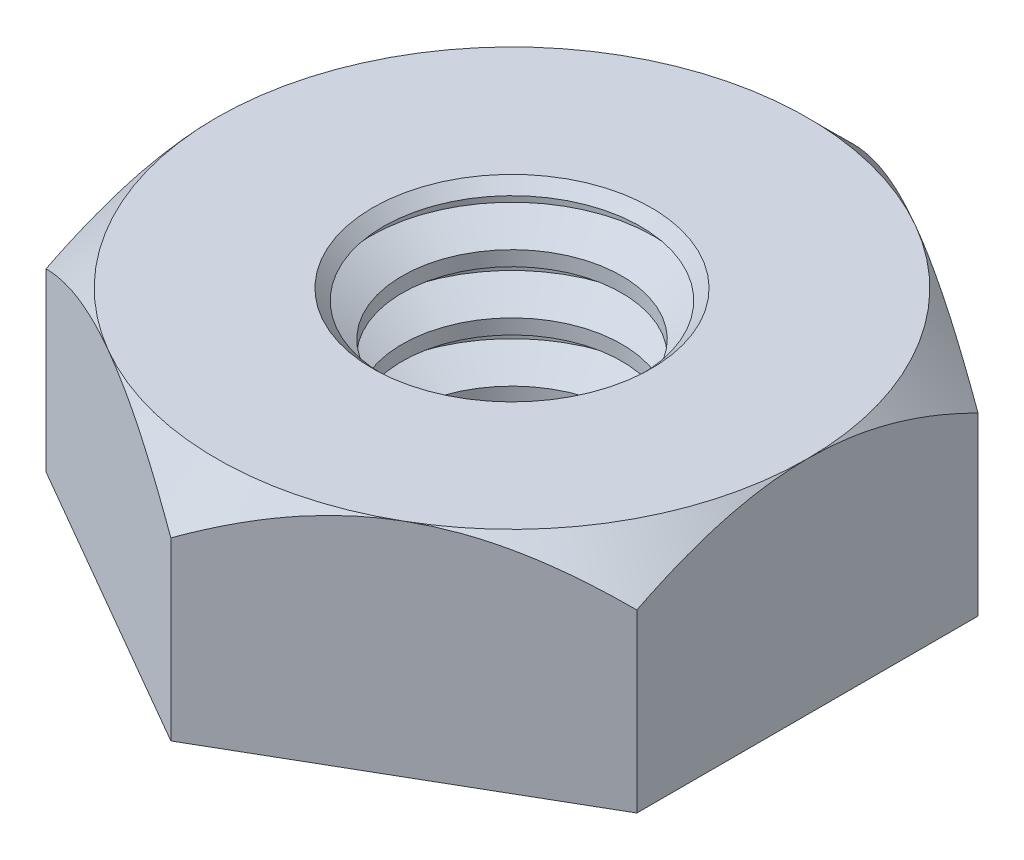
ISO-10303-21;
HEADER;
FILE_DESCRIPTION(('STEP AP214'),'2;1');
FILE_NAME('part.step','',(''),(''),'','','');
FILE_SCHEMA(('AUTOMOTIVE_DESIGN { 1 0 10303 214 1 1 1 1 }'));
ENDSEC;
DATA;
#1=APPLICATION_CONTEXT('core data for automotive mechanical design processes');
#2=APPLICATION_PROTOCOL_DEFINITION('international standard','automotive_design',2000,#1);
#3=PRODUCT_CONTEXT('',#1,'mechanical');
#4=PRODUCT('Part','Part','',(#3));
#5=PRODUCT_RELATED_PRODUCT_CATEGORY('part','',(#4));
#6=PRODUCT_DEFINITION_FORMATION('','',#4);
#7=PRODUCT_DEFINITION_CONTEXT('part definition',#1,'design');
#8=PRODUCT_DEFINITION('design','',#6,#7);
#9=PRODUCT_DEFINITION_SHAPE('','',#8);
#10=(LENGTH_UNIT() NAMED_UNIT(*) SI_UNIT(.MILLI.,.METRE.));
#11=(NAMED_UNIT(*) PLANE_ANGLE_UNIT() SI_UNIT($,.RADIAN.));
#12=(NAMED_UNIT(*) SI_UNIT($,.STERADIAN.) SOLID_ANGLE_UNIT());
#13=UNCERTAINTY_MEASURE_WITH_UNIT(LENGTH_MEASURE(1.E-05),#10,'distance_accuracy_value','');
#14=(GEOMETRIC_REPRESENTATION_CONTEXT(3) GLOBAL_UNCERTAINTY_ASSIGNED_CONTEXT((#13)) GLOBAL_UNIT_ASSIGNED_CONTEXT((#10,
#11,#12)) REPRESENTATION_CONTEXT('',''));
#15=CARTESIAN_POINT('',(0.,0.,0.));
#16=DIRECTION('',(0.,0.,1.));
#17=DIRECTION('',(1.,0.,0.));
#18=AXIS2_PLACEMENT_3D('',#15,#16,#17);
#19=CARTESIAN_POINT('',(0.,0.41671875,0.));
#20=DIRECTION('',(0.,1.,0.));
#21=DIRECTION('',(-1.,0.,0.));
#22=AXIS2_PLACEMENT_3D('',#19,#20,#21);
#23=CYLINDRICAL_SURFACE('',#22,0.762);
#24=CARTESIAN_POINT('',(0.,0.416718749999934,0.));
#25=DIRECTION('',(0.,1.,0.));
#26=DIRECTION('',(0.,0.,1.));
#27=AXIS2_PLACEMENT_3D('',#24,#25,#26);
#28=CIRCLE('',#27,0.762);
#29=CARTESIAN_POINT('',(0.,0.41671875,0.762));
#30=VERTEX_POINT('',#29);
#31=EDGE_CURVE('E134',#30,#30,#28,.T.);
#32=ORIENTED_EDGE('',*,*,#31,.F.);
#33=EDGE_LOOP('',(#32));
#34=FACE_BOUND('',#33,.T.);
#35=CARTESIAN_POINT('',(0.,0.456406249999985,0.));
#36=DIRECTION('',(0.,-1.,0.));
#37=DIRECTION('',(0.,0.,-1.));
#38=AXIS2_PLACEMENT_3D('',#35,#36,#37);
#39=CIRCLE('',#38,0.762);
#40=CARTESIAN_POINT('',(0.,0.45640625,-0.762));
#41=VERTEX_POINT('',#40);
#42=EDGE_CURVE('E137',#41,#41,#39,.T.);
#43=ORIENTED_EDGE('',*,*,#42,.F.);
#44=EDGE_LOOP('',(#43));
#45=FACE_BOUND('',#44,.T.);
#46=ADVANCED_FACE('F16',(#34,#45),#23,.F.);
#47=CARTESIAN_POINT('',(0.,0.555625,0.));
#48=DIRECTION('',(0.,-1.,0.));
#49=DIRECTION('',(1.,0.,0.));
#50=AXIS2_PLACEMENT_3D('',#47,#48,#49);
#51=CONICAL_SURFACE('',#50,0.5901480958,1.04719752130438);
#52=CARTESIAN_POINT('',(0.,0.555625,0.));
#53=DIRECTION('',(0.,1.,0.));
#54=DIRECTION('',(0.,0.,1.));
#55=AXIS2_PLACEMENT_3D('',#52,#53,#54);
#56=CIRCLE('',#55,0.5901480958);
#57=CARTESIAN_POINT('',(0.,0.555625,0.5901480958));
#58=VERTEX_POINT('',#57);
#59=EDGE_CURVE('E131',#58,#58,#56,.F.);
#60=ORIENTED_EDGE('',*,*,#59,.F.);
#61=EDGE_LOOP('',(#60));
#62=FACE_BOUND('',#61,.T.);
#63=ORIENTED_EDGE('',*,*,#42,.T.);
#64=EDGE_LOOP('',(#63));
#65=FACE_BOUND('',#64,.T.);
#66=ADVANCED_FACE('F286',(#62,#65),#51,.F.);
#67=CARTESIAN_POINT('',(0.,0.3175,0.));
#68=DIRECTION('',(0.,1.,0.));
#69=DIRECTION('',(0.,0.,1.));
#70=AXIS2_PLACEMENT_3D('',#67,#68,#69);
#71=CONICAL_SURFACE('',#70,0.5901480958,1.04719752130438);
#72=CARTESIAN_POINT('',(0.,0.3175,0.));
#73=DIRECTION('',(0.,1.,0.));
#74=DIRECTION('',(0.,0.,1.));
#75=AXIS2_PLACEMENT_3D('',#72,#73,#74);
#76=CIRCLE('',#75,0.5901480958);
#77=CARTESIAN_POINT('',(0.,0.3175,0.5901480958));
#78=VERTEX_POINT('',#77);
#79=EDGE_CURVE('E128',#78,#78,#76,.T.);
#80=ORIENTED_EDGE('',*,*,#79,.F.);
#81=EDGE_LOOP('',(#80));
#82=FACE_BOUND('',#81,.T.);
#83=ORIENTED_EDGE('',*,*,#31,.T.);
#84=EDGE_LOOP('',(#83));
#85=FACE_BOUND('',#84,.T.);
#86=ADVANCED_FACE('F282',(#82,#85),#71,.F.);
#87=CARTESIAN_POINT('',(0.,0.555625,0.));
#88=DIRECTION('',(0.,1.,0.));
#89=DIRECTION('',(-1.,0.,0.));
#90=AXIS2_PLACEMENT_3D('',#87,#88,#89);
#91=CYLINDRICAL_SURFACE('',#90,0.5901480958);
#92=ORIENTED_EDGE('',*,*,#59,.T.);
#93=EDGE_LOOP('',(#92));
#94=FACE_BOUND('',#93,.T.);
#95=CARTESIAN_POINT('',(0.,0.635000000000052,0.));
#96=DIRECTION('',(0.,1.,0.));
#97=DIRECTION('',(0.,0.,1.));
#98=AXIS2_PLACEMENT_3D('',#95,#96,#97);
#99=CIRCLE('',#98,0.5901480958);
#100=CARTESIAN_POINT('',(0.,0.635,0.5901480958));
#101=VERTEX_POINT('',#100);
#102=EDGE_CURVE('E125',#101,#101,#99,.F.);
#103=ORIENTED_EDGE('',*,*,#102,.F.);
#104=EDGE_LOOP('',(#103));
#105=FACE_BOUND('',#104,.T.);
#106=ADVANCED_FACE('F278',(#94,#105),#91,.F.);
#107=CARTESIAN_POINT('',(0.,0.238125,0.));
#108=DIRECTION('',(0.,1.,0.));
#109=DIRECTION('',(0.,0.,1.));
#110=AXIS2_PLACEMENT_3D('',#107,#108,#109);
#111=CYLINDRICAL_SURFACE('',#110,0.5901480958);
#112=CARTESIAN_POINT('',(0.,0.238124999999978,0.));
#113=DIRECTION('',(0.,-1.,0.));
#114=DIRECTION('',(0.,0.,-1.));
#115=AXIS2_PLACEMENT_3D('',#112,#113,#114);
#116=CIRCLE('',#115,0.5901480958);
#117=CARTESIAN_POINT('',(0.,0.238125,-0.5901480958));
#118=VERTEX_POINT('',#117);
#119=EDGE_CURVE('E122',#118,#118,#116,.F.);
#120=ORIENTED_EDGE('',*,*,#119,.F.);
#121=EDGE_LOOP('',(#120));
#122=FACE_BOUND('',#121,.T.);
#123=ORIENTED_EDGE('',*,*,#79,.T.);
#124=EDGE_LOOP('',(#123));
#125=FACE_BOUND('',#124,.T.);
#126=ADVANCED_FACE('F274',(#122,#125),#111,.F.);
#127=CARTESIAN_POINT('',(0.,0.635,0.));
#128=DIRECTION('',(0.,1.,0.));
#129=DIRECTION('',(0.,0.,1.));
#130=AXIS2_PLACEMENT_3D('',#127,#128,#129);
#131=CONICAL_SURFACE('',#130,0.5901480958,1.04719752130438);
#132=ORIENTED_EDGE('',*,*,#102,.T.);
#133=EDGE_LOOP('',(#132));
#134=FACE_BOUND('',#133,.T.);
#135=CARTESIAN_POINT('',(0.,0.73421875,0.));
#136=DIRECTION('',(0.,1.,0.));
#137=DIRECTION('',(0.,0.,1.));
#138=AXIS2_PLACEMENT_3D('',#135,#136,#137);
#139=CIRCLE('',#138,0.762);
#140=CARTESIAN_POINT('',(0.,0.73421875,0.762));
#141=VERTEX_POINT('',#140);
#142=EDGE_CURVE('E118',#141,#141,#139,.F.);
#143=ORIENTED_EDGE('',*,*,#142,.F.);
#144=EDGE_LOOP('',(#143));
#145=FACE_BOUND('',#144,.T.);
#146=ADVANCED_FACE('F270',(#134,#145),#131,.F.);
#147=CARTESIAN_POINT('',(0.,0.238125,0.));
#148=DIRECTION('',(0.,-1.,0.));
#149=DIRECTION('',(0.,0.,-1.));
#150=AXIS2_PLACEMENT_3D('',#147,#148,#149);
#151=CONICAL_SURFACE('',#150,0.5901480958,1.04719752130438);
#152=ORIENTED_EDGE('',*,*,#119,.T.);
#153=EDGE_LOOP('',(#152));
#154=FACE_BOUND('',#153,.T.);
#155=CARTESIAN_POINT('',(0.,0.13890625,0.));
#156=DIRECTION('',(0.,1.,0.));
#157=DIRECTION('',(0.,0.,1.));
#158=AXIS2_PLACEMENT_3D('',#155,#156,#157);
#159=CIRCLE('',#158,0.762);
#160=CARTESIAN_POINT('',(0.,0.13890625,0.762));
#161=VERTEX_POINT('',#160);
#162=EDGE_CURVE('E113',#161,#161,#159,.T.);
#163=ORIENTED_EDGE('',*,*,#162,.F.);
#164=EDGE_LOOP('',(#163));
#165=FACE_BOUND('',#164,.T.);
#166=ADVANCED_FACE('F266',(#154,#165),#151,.F.);
#167=CARTESIAN_POINT('',(0.,0.73421875,0.));
#168=DIRECTION('',(0.,1.,0.));
#169=DIRECTION('',(-1.,0.,0.));
#170=AXIS2_PLACEMENT_3D('',#167,#168,#169);
#171=CYLINDRICAL_SURFACE('',#170,0.762);
#172=ORIENTED_EDGE('',*,*,#142,.T.);
#173=EDGE_LOOP('',(#172));
#174=FACE_BOUND('',#173,.T.);
#175=CARTESIAN_POINT('',(0.,0.773906249999956,0.));
#176=DIRECTION('',(0.,-1.,0.));
#177=DIRECTION('',(0.,0.,-1.));
#178=AXIS2_PLACEMENT_3D('',#175,#176,#177);
#179=CIRCLE('',#178,0.762);
#180=CARTESIAN_POINT('',(0.,0.77390625,-0.762));
#181=VERTEX_POINT('',#180);
#182=EDGE_CURVE('E111',#181,#181,#179,.T.);
#183=ORIENTED_EDGE('',*,*,#182,.F.);
#184=EDGE_LOOP('',(#183));
#185=FACE_BOUND('',#184,.T.);
#186=ADVANCED_FACE('F262',(#174,#185),#171,.F.);
#187=CARTESIAN_POINT('',(0.,0.09921875,0.));
#188=DIRECTION('',(0.,1.,0.));
#189=DIRECTION('',(-1.,0.,0.));
#190=AXIS2_PLACEMENT_3D('',#187,#188,#189);
#191=CYLINDRICAL_SURFACE('',#190,0.762);
#192=CARTESIAN_POINT('',(0.,0.0992187500000741,0.));
#193=DIRECTION('',(0.,1.,0.));
#194=DIRECTION('',(0.,0.,1.));
#195=AXIS2_PLACEMENT_3D('',#192,#193,#194);
#196=CIRCLE('',#195,0.762);
#197=CARTESIAN_POINT('',(0.,0.09921875,0.762));
#198=VERTEX_POINT('',#197);
#199=EDGE_CURVE('E377',#198,#198,#196,.T.);
#200=ORIENTED_EDGE('',*,*,#199,.F.);
#201=EDGE_LOOP('',(#200));
#202=FACE_BOUND('',#201,.T.);
#203=ORIENTED_EDGE('',*,*,#162,.T.);
#204=EDGE_LOOP('',(#203));
#205=FACE_BOUND('',#204,.T.);
#206=ADVANCED_FACE('F258',(#202,#205),#191,.F.);
#207=CARTESIAN_POINT('',(0.,0.873125,0.));
#208=DIRECTION('',(0.,-1.,0.));
#209=DIRECTION('',(0.,0.,-1.));
#210=AXIS2_PLACEMENT_3D('',#207,#208,#209);
#211=CONICAL_SURFACE('',#210,0.5901480958,1.04719752130438);
#212=CARTESIAN_POINT('',(0.,0.873125,0.));
#213=DIRECTION('',(0.,1.,0.));
#214=DIRECTION('',(0.,0.,1.));
#215=AXIS2_PLACEMENT_3D('',#212,#213,#214);
#216=CIRCLE('',#215,0.5901480958);
#217=CARTESIAN_POINT('',(0.,0.873125,0.5901480958));
#218=VERTEX_POINT('',#217);
#219=EDGE_CURVE('E375',#218,#218,#216,.F.);
#220=ORIENTED_EDGE('',*,*,#219,.F.);
#221=EDGE_LOOP('',(#220));
#222=FACE_BOUND('',#221,.T.);
#223=ORIENTED_EDGE('',*,*,#182,.T.);
#224=EDGE_LOOP('',(#223));
#225=FACE_BOUND('',#224,.T.);
#226=ADVANCED_FACE('F255',(#222,#225),#211,.F.);
#227=CARTESIAN_POINT('',(-1.5875,0.,-0.9165435568));
#228=DIRECTION('',(0.500000001825392,0.,0.866025402730548));
#229=DIRECTION('',(0.866025402730548,0.,-0.500000001825392));
#230=AXIS2_PLACEMENT_3D('',#227,#228,#229);
#231=PLANE('',#230);
#232=DIRECTION('',(0.,-1.,0.));
#233=VECTOR('',#232,1.);
#234=CARTESIAN_POINT('',(0.,0.598884375,-1.8330871136));
#235=LINE('',#234,#233);
#236=CARTESIAN_POINT('',(-2.37763028148505E-09,0.945037887772726,-1.83308711222727));
#237=VERTEX_POINT('',#236);
#238=CARTESIAN_POINT('',(0.,0.,-1.8330871136));
#239=VERTEX_POINT('',#238);
#240=EDGE_CURVE('E331',#237,#239,#235,.T.);
#241=ORIENTED_EDGE('',*,*,#240,.T.);
#242=DIRECTION('',(0.866025402730548,0.,-0.500000001825392));
#243=VECTOR('',#242,1.);
#244=CARTESIAN_POINT('',(-1.5875,0.,-0.9165435568));
#245=LINE('',#244,#243);
#246=CARTESIAN_POINT('',(-1.5875,0.,-0.9165435568));
#247=VERTEX_POINT('',#246);
#248=EDGE_CURVE('E94',#239,#247,#245,.F.);
#249=ORIENTED_EDGE('',*,*,#248,.T.);
#250=DIRECTION('',(0.,-1.,0.));
#251=VECTOR('',#250,1.);
#252=CARTESIAN_POINT('',(-1.5875,0.598884375,-0.9165435568));
#253=LINE('',#252,#251);
#254=CARTESIAN_POINT('',(-1.5875,0.945037893873366,-0.916543555237676));
#255=VERTEX_POINT('',#254);
#256=EDGE_CURVE('E91',#255,#247,#253,.T.);
#257=ORIENTED_EDGE('',*,*,#256,.F.);
#258=CARTESIAN_POINT('',(-0.793750000552454,1.19062499366369,-1.37481533337376));
#259=CARTESIAN_POINT('',(-0.835986126793097,1.19066585235424,-1.35043029536721));
#260=CARTESIAN_POINT('',(-0.878200757029689,1.18837855153961,-1.32605766751364));
#261=CARTESIAN_POINT('',(-0.962212733226221,1.17946872747669,-1.27755333049438));
#262=CARTESIAN_POINT('',(-1.00401069183696,1.17285398747406,-1.25342126761548));
#263=CARTESIAN_POINT('',(-1.08634310881512,1.15573831910838,-1.20588662420239));
#264=CARTESIAN_POINT('',(-1.12688711564796,1.14529750606171,-1.18247853085707));
#265=CARTESIAN_POINT('',(-1.207203097129,1.12099489836542,-1.13610807712362));
#266=CARTESIAN_POINT('',(-1.24697482576967,1.10713203230411,-1.113145858768));
#267=CARTESIAN_POINT('',(-1.33771942050805,1.07179492466665,-1.06075444230572));
#268=CARTESIAN_POINT('',(-1.38838771960623,1.04929020434904,-1.03150108604173));
#269=CARTESIAN_POINT('',(-1.48878951499315,1.00006445002032,-0.973534082170124));
#270=CARTESIAN_POINT('',(-1.53850808392261,0.973302520795781,-0.944829052877444));
#271=CARTESIAN_POINT('',(-1.58749999817515,0.945037894145785,-0.916543557853581));
#272=B_SPLINE_CURVE_WITH_KNOTS('',3,(#258,#259,#260,#261,#262,#263,#264,#265,#266,#267,#268,
#269,#270,#271),.UNSPECIFIED.,.F.,.F.,(4,2,2,2,2,2,4),(0.,0.146217040488063,0.292171818267053,
0.435925335012758,0.579723916806516,0.767612797569133,0.957429661101636),.UNSPECIFIED.);
#273=CARTESIAN_POINT('',(-0.793750000314738,1.19062499710219,-1.37481533167218));
#274=VERTEX_POINT('',#273);
#275=EDGE_CURVE('E20',#274,#255,#272,.T.);
#276=ORIENTED_EDGE('',*,*,#275,.F.);
#277=CARTESIAN_POINT('',(-4.65921772675704E-09,0.945037889009626,-1.83308711055237));
#278=CARTESIAN_POINT('',(-0.0549115002484921,0.97671119119828,-1.80138394386697));
#279=CARTESIAN_POINT('',(-0.11075107016014,1.00651329718213,-1.76914495308422));
#280=CARTESIAN_POINT('',(-0.224656508605619,1.06104947999327,-1.70338161728472));
#281=CARTESIAN_POINT('',(-0.282734284439278,1.08575009449029,-1.66985039758442));
#282=CARTESIAN_POINT('',(-0.399072122464851,1.12769739618767,-1.60268271513841));
#283=CARTESIAN_POINT('',(-0.457277830425626,1.14513985429823,-1.5690776338219));
#284=CARTESIAN_POINT('',(-0.57493786798493,1.17201369767989,-1.50114657913809));
#285=CARTESIAN_POINT('',(-0.634387806870194,1.18146955615573,-1.46682314075032));
#286=CARTESIAN_POINT('',(-0.710630746621199,1.18784197572254,-1.4228042587466));
#287=CARTESIAN_POINT('',(-0.727201517400413,1.18888193731125,-1.41323711973002));
#288=CARTESIAN_POINT('',(-0.760430415469626,1.19027453907862,-1.39405240639158));
#289=CARTESIAN_POINT('',(-0.777088628790848,1.19062444045338,-1.38443478239958));
#290=CARTESIAN_POINT('',(-0.793750001171269,1.19062499420438,-1.37481533452377));
#291=B_SPLINE_CURVE_WITH_KNOTS('',3,(#277,#278,#279,#280,#281,#282,#283,#284,#285,#286,#287,
#288,#289,#290),.UNSPECIFIED.,.F.,.F.,(4,2,2,2,2,2,4),(0.,0.212787984996615,0.426930246192678,
0.634848855551885,0.842128007724277,0.899606630997608,0.957312927700399),.UNSPECIFIED.);
#292=EDGE_CURVE('E98',#237,#274,#291,.T.);
#293=ORIENTED_EDGE('',*,*,#292,.F.);
#294=EDGE_LOOP('',(#241,#249,#257,#276,#293));
#295=FACE_BOUND('',#294,.T.);
#296=ADVANCED_FACE('F93',(#295),#231,.F.);
#297=CARTESIAN_POINT('',(0.,0.,1.8330871136));
#298=DIRECTION('',(0.500000001825392,0.,-0.866025402730548));
#299=DIRECTION('',(-0.866025402730548,0.,-0.500000001825392));
#300=AXIS2_PLACEMENT_3D('',#297,#298,#299);
#301=PLANE('',#300);
#302=DIRECTION('',(0.,1.,0.));
#303=VECTOR('',#302,1.);
#304=CARTESIAN_POINT('',(-1.5875,0.598884375,0.9165435568));
#305=LINE('',#304,#303);
#306=CARTESIAN_POINT('',(-1.5875,0.,0.9165435568));
#307=VERTEX_POINT('',#306);
#308=CARTESIAN_POINT('',(-1.58749999913226,0.945037894389001,0.916543555709377));
#309=VERTEX_POINT('',#308);
#310=EDGE_CURVE('E188',#307,#309,#305,.T.);
#311=ORIENTED_EDGE('',*,*,#310,.F.);
#312=DIRECTION('',(-0.866025402730548,0.,-0.500000001825392));
#313=VECTOR('',#312,1.);
#314=CARTESIAN_POINT('',(0.,0.,1.8330871136));
#315=LINE('',#314,#313);
#316=CARTESIAN_POINT('',(0.,0.,1.8330871136));
#317=VERTEX_POINT('',#316);
#318=EDGE_CURVE('E371',#307,#317,#315,.F.);
#319=ORIENTED_EDGE('',*,*,#318,.T.);
#320=DIRECTION('',(0.,1.,0.));
#321=VECTOR('',#320,1.);
#322=CARTESIAN_POINT('',(0.,0.598884375,1.8330871136));
#323=LINE('',#322,#321);
#324=CARTESIAN_POINT('',(0.,0.945037888244041,1.83308711175596));
#325=VERTEX_POINT('',#324);
#326=EDGE_CURVE('E223',#317,#325,#323,.T.);
#327=ORIENTED_EDGE('',*,*,#326,.T.);
#328=CARTESIAN_POINT('',(-0.793750000631719,1.19062499366369,1.37481533332799));
#329=CARTESIAN_POINT('',(-0.75151387501637,1.19066585203127,1.39920037290695));
#330=CARTESIAN_POINT('',(-0.709299244925699,1.1883785508714,1.42357300146809));
#331=CARTESIAN_POINT('',(-0.625287268615773,1.17946872609469,1.47207733913095));
#332=CARTESIAN_POINT('',(-0.583489309746431,1.17285398572375,1.49620940194726));
#333=CARTESIAN_POINT('',(-0.501156892388047,1.15573831662181,1.54374404542721));
#334=CARTESIAN_POINT('',(-0.46061288543158,1.14529750320645,1.56715213889908));
#335=CARTESIAN_POINT('',(-0.380296903691365,1.12099489478114,1.61352259282332));
#336=CARTESIAN_POINT('',(-0.340525174915156,1.10713202835944,1.63648481124316));
#337=CARTESIAN_POINT('',(-0.249780580168895,1.07179492002008,1.6888762276949));
#338=CARTESIAN_POINT('',(-0.199112281196876,1.04929019939426,1.7181295838903));
#339=CARTESIAN_POINT('',(-0.0987104860673466,1.0000644445216,1.77609658762194));
#340=CARTESIAN_POINT('',(-0.0489919172687792,0.973302515062867,1.80480161684343));
#341=CARTESIAN_POINT('',(-3.13276614025397E-09,0.945037888208704,1.8330871117913));
#342=B_SPLINE_CURVE_WITH_KNOTS('',3,(#328,#329,#330,#331,#332,#333,#334,#335,#336,#337,#338,
#339,#340,#341),.UNSPECIFIED.,.F.,.F.,(4,2,2,2,2,2,4),(0.,0.1462170412178,0.29217181971837,
0.435925337204307,0.579723919740895,0.76761280043884,0.957429663869614),.UNSPECIFIED.);
#343=CARTESIAN_POINT('',(-0.7937500005129,1.19062499710219,1.37481533155778));
#344=VERTEX_POINT('',#343);
#345=EDGE_CURVE('E195',#344,#325,#342,.T.);
#346=ORIENTED_EDGE('',*,*,#345,.F.);
#347=CARTESIAN_POINT('',(-1.58749999774577,0.945037893764427,0.916543557233234));
#348=CARTESIAN_POINT('',(-1.53258850307019,0.976711195522724,0.948246724176064));
#349=CARTESIAN_POINT('',(-1.47674893385683,1.00651330101113,0.980485714878221));
#350=CARTESIAN_POINT('',(-1.36284349666052,1.06104948281587,1.04624905019398));
#351=CARTESIAN_POINT('',(-1.30476572137713,1.08575009680314,1.07978026948887));
#352=CARTESIAN_POINT('',(-1.1884278845377,1.12769739761894,1.14694795118818));
#353=CARTESIAN_POINT('',(-1.13022217720971,1.14513985535387,1.18055303216196));
#354=CARTESIAN_POINT('',(-1.01256214093965,1.172013698138,1.24848408611715));
#355=CARTESIAN_POINT('',(-0.953112202710606,1.18146955639069,1.28280752411926));
#356=CARTESIAN_POINT('',(-0.876869262340939,1.18784197592357,1.32682640647881));
#357=CARTESIAN_POINT('',(-0.86029849027417,1.18888193754781,1.33639354623891));
#358=CARTESIAN_POINT('',(-0.827069589617772,1.1902745392788,1.35557826107136));
#359=CARTESIAN_POINT('',(-0.810411374996908,1.19062444058097,1.36519588581385));
#360=CARTESIAN_POINT('',(-0.79375000131825,1.19062499420438,1.37481533443891));
#361=B_SPLINE_CURVE_WITH_KNOTS('',3,(#347,#348,#349,#350,#351,#352,#353,#354,#355,#356,#357,
#358,#359,#360),.UNSPECIFIED.,.F.,.F.,(4,2,2,2,2,2,4),(0.,0.212787982621738,0.426930241377877,
0.63484884837626,0.842127998215692,0.899606625946187,0.957312927144079),.UNSPECIFIED.);
#362=EDGE_CURVE('E179',#309,#344,#361,.T.);
#363=ORIENTED_EDGE('',*,*,#362,.F.);
#364=EDGE_LOOP('',(#311,#319,#327,#346,#363));
#365=FACE_BOUND('',#364,.T.);
#366=ADVANCED_FACE('F200',(#365),#301,.F.);
#367=CARTESIAN_POINT('',(1.5875,0.,0.9165435568));
#368=DIRECTION('',(-0.500000001825392,0.,-0.866025402730548));
#369=DIRECTION('',(-0.866025402730548,0.,0.500000001825392));
#370=AXIS2_PLACEMENT_3D('',#367,#368,#369);
#371=PLANE('',#370);
#372=ORIENTED_EDGE('',*,*,#326,.F.);
#373=DIRECTION('',(-0.866025402730548,0.,0.500000001825392));
#374=VECTOR('',#373,1.);
#375=CARTESIAN_POINT('',(1.5875,0.,0.9165435568));
#376=LINE('',#375,#374);
#377=CARTESIAN_POINT('',(1.5875,0.,0.9165435568));
#378=VERTEX_POINT('',#377);
#379=EDGE_CURVE('E360',#317,#378,#376,.F.);
#380=ORIENTED_EDGE('',*,*,#379,.T.);
#381=DIRECTION('',(0.,1.,0.));
#382=VECTOR('',#381,1.);
#383=CARTESIAN_POINT('',(1.5875,0.598884375,0.9165435568));
#384=LINE('',#383,#382);
#385=CARTESIAN_POINT('',(1.58749999956214,0.945037893597803,0.9165435565472));
#386=VERTEX_POINT('',#385);
#387=EDGE_CURVE('E368',#378,#386,#384,.T.);
#388=ORIENTED_EDGE('',*,*,#387,.T.);
#389=CARTESIAN_POINT('',(0.793750000693443,1.19062499366369,1.37481533329236));
#390=CARTESIAN_POINT('',(0.835986126937543,1.19066585234924,1.35043029528381));
#391=CARTESIAN_POINT('',(0.87820075717736,1.18837855152924,1.32605766742838));
#392=CARTESIAN_POINT('',(0.962212733379833,1.1794687274552,1.27755333040569));
#393=CARTESIAN_POINT('',(1.00401069199329,1.17285398744682,1.25342126752522));
#394=CARTESIAN_POINT('',(1.08634310897627,1.15573831906968,1.20588662410934));
#395=CARTESIAN_POINT('',(1.12688711581123,1.14529750601732,1.1824785307628));
#396=CARTESIAN_POINT('',(1.20720309729625,1.1209948983098,1.13610807702706));
#397=CARTESIAN_POINT('',(1.24697482593878,1.10713203224295,1.11314585867036));
#398=CARTESIAN_POINT('',(1.33771942081786,1.07179492453986,1.06075444212685));
#399=CARTESIAN_POINT('',(1.3883877200509,1.04929020414907,1.031501085785));
#400=CARTESIAN_POINT('',(1.48878951570279,1.00006444965429,0.973534081760416));
#401=CARTESIAN_POINT('',(1.53850808476223,0.973302520336575,0.944829052392691));
#402=CARTESIAN_POINT('',(1.58749999914106,0.945037893588115,0.916543557295911));
#403=B_SPLINE_CURVE_WITH_KNOTS('',3,(#389,#390,#391,#392,#393,#394,#395,#396,#397,#398,#399,
#400,#401,#402),.UNSPECIFIED.,.F.,.F.,(4,2,2,2,2,2,4),(0.,0.146217040499969,0.292171818290612,
0.435925335047192,0.579723916851971,0.767612798128207,0.957429662185306),.UNSPECIFIED.);
#404=CARTESIAN_POINT('',(0.793750000667211,1.19062499710219,1.37481533146868));
#405=VERTEX_POINT('',#404);
#406=EDGE_CURVE('E187',#405,#386,#403,.T.);
#407=ORIENTED_EDGE('',*,*,#406,.F.);
#408=CARTESIAN_POINT('',(3.55288529599181E-09,0.945037888751622,1.8330871128852));
#409=CARTESIAN_POINT('',(0.0549114989771714,0.976711190648004,1.8013839452103));
#410=CARTESIAN_POINT('',(0.110751068906773,1.00651329658194,1.76914495397142));
#411=CARTESIAN_POINT('',(0.224656507566879,1.06104947949634,1.70338161771984));
#412=CARTESIAN_POINT('',(0.282734283598623,1.08575009414683,1.66985039802638));
#413=CARTESIAN_POINT('',(0.399072121986267,1.1276973960542,1.60268271545685));
#414=CARTESIAN_POINT('',(0.457277830111996,1.14513985422371,1.56907763401386));
#415=CARTESIAN_POINT('',(0.574937868017724,1.17201369769023,1.50114657910831));
#416=CARTESIAN_POINT('',(0.634387807084296,1.18146955619258,1.46682314062524));
#417=CARTESIAN_POINT('',(0.710630746973237,1.18784197574666,1.42280425854376));
#418=CARTESIAN_POINT('',(0.727201517710754,1.18888193732808,1.41323711955104));
#419=CARTESIAN_POINT('',(0.760430415695674,1.19027453908427,1.39405240626087));
#420=CARTESIAN_POINT('',(0.777088628974298,1.19062444045517,1.38443478229326));
#421=CARTESIAN_POINT('',(0.793750001312258,1.19062499420438,1.37481533444237));
#422=B_SPLINE_CURVE_WITH_KNOTS('',3,(#408,#409,#410,#411,#412,#413,#414,#415,#416,#417,#418,
#419,#420,#421),.UNSPECIFIED.,.F.,.F.,(4,2,2,2,2,2,4),(0.,0.212787985597083,0.426930247435815,
0.634848857427728,0.842128010216999,0.899606633345213,0.957312929900551),.UNSPECIFIED.);
#423=EDGE_CURVE('E216',#325,#405,#422,.T.);
#424=ORIENTED_EDGE('',*,*,#423,.F.);
#425=EDGE_LOOP('',(#372,#380,#388,#407,#424));
#426=FACE_BOUND('',#425,.T.);
#427=ADVANCED_FACE('F203',(#426),#371,.F.);
#428=CARTESIAN_POINT('',(1.5875,0.,-0.9165435568));
#429=DIRECTION('',(-1.,0.,0.));
#430=DIRECTION('',(0.,0.,1.));
#431=AXIS2_PLACEMENT_3D('',#428,#429,#430);
#432=PLANE('',#431);
#433=ORIENTED_EDGE('',*,*,#387,.F.);
#434=DIRECTION('',(0.,0.,-1.));
#435=VECTOR('',#434,1.);
#436=CARTESIAN_POINT('',(1.5875,0.,0.));
#437=LINE('',#436,#435);
#438=CARTESIAN_POINT('',(1.5875,0.,-0.9165435568));
#439=VERTEX_POINT('',#438);
#440=EDGE_CURVE('E357',#378,#439,#437,.T.);
#441=ORIENTED_EDGE('',*,*,#440,.T.);
#442=DIRECTION('',(0.,1.,0.));
#443=VECTOR('',#442,1.);
#444=CARTESIAN_POINT('',(1.5875,0.598884375,-0.9165435568));
#445=LINE('',#444,#443);
#446=CARTESIAN_POINT('',(1.58749999956214,0.945037893597803,-0.916543556547201));
#447=VERTEX_POINT('',#446);
#448=EDGE_CURVE('E391',#439,#447,#445,.T.);
#449=ORIENTED_EDGE('',*,*,#448,.T.);
#450=CARTESIAN_POINT('',(1.5875,1.190625,8.14003988970764E-11));
#451=CARTESIAN_POINT('',(1.5875,1.19066585818398,-0.0487700771227695));
#452=CARTESIAN_POINT('',(1.5875,1.1883785570658,-0.0975153331658283));
#453=CARTESIAN_POINT('',(1.5875,1.17946873258106,-0.194524007124597));
#454=CARTESIAN_POINT('',(1.5875,1.17285399245925,-0.242788132468024));
#455=CARTESIAN_POINT('',(1.5875,1.15573832381993,-0.337857418671534));
#456=CARTESIAN_POINT('',(1.5875,1.14529751061849,-0.384673605150854));
#457=CARTESIAN_POINT('',(1.5875,1.12099490264136,-0.477414512137618));
#458=CARTESIAN_POINT('',(1.5875,1.10713203645412,-0.523338948580071));
#459=CARTESIAN_POINT('',(1.5875,1.07179492809176,-0.628121782241005));
#460=CARTESIAN_POINT('',(1.5875,1.04929020706831,-0.686628495739784));
#461=CARTESIAN_POINT('',(1.5875,1.00006445118809,-0.802562505374658));
#462=CARTESIAN_POINT('',(1.5875,0.973302521116066,-0.859972564879956));
#463=CARTESIAN_POINT('',(1.5875,0.945037893588115,-0.916543555808179));
#464=B_SPLINE_CURVE_WITH_KNOTS('',3,(#450,#451,#452,#453,#454,#455,#456,#457,#458,#459,#460,
#461,#462,#463),.UNSPECIFIED.,.F.,.F.,(4,2,2,2,2,2,4),(0.,0.146217040291232,0.292171817893668,
0.43592533449663,0.579723916142197,0.767612800962752,0.957429668618981),.UNSPECIFIED.);
#465=CARTESIAN_POINT('',(1.5875,1.190625,1.62800846384044E-10));
#466=VERTEX_POINT('',#465);
#467=EDGE_CURVE('E222',#466,#447,#464,.T.);
#468=ORIENTED_EDGE('',*,*,#467,.F.);
#469=CARTESIAN_POINT('',(1.58750000031734,0.945037893736972,0.916543555858386));
#470=CARTESIAN_POINT('',(1.58750000011414,0.97671119589664,0.853137222223968));
#471=CARTESIAN_POINT('',(1.58750000003064,1.00651330195806,0.788659240644939));
#472=CARTESIAN_POINT('',(1.58749999996917,1.06104948500904,0.657132569225632));
#473=CARTESIAN_POINT('',(1.58749999999187,1.08575009966809,0.590070130019318));
#474=CARTESIAN_POINT('',(1.58750000000789,1.12769740162146,0.455734765463118));
#475=CARTESIAN_POINT('',(1.58750000000204,1.14513985983,0.388524602974481));
#476=CARTESIAN_POINT('',(1.58749999999797,1.17201370336847,0.252662493904013));
#477=CARTESIAN_POINT('',(1.58749999999973,1.18146956190366,0.184015617281303));
#478=CARTESIAN_POINT('',(1.58750000000008,1.18784198156842,0.0959778526112247));
#479=CARTESIAN_POINT('',(1.58750000000004,1.18888194319364,0.0768435737662879));
#480=CARTESIAN_POINT('',(1.58749999999996,1.19027454496795,0.0384741454570839));
#481=CARTESIAN_POINT('',(1.58749999999992,1.19062444631273,0.0192388966525064));
#482=CARTESIAN_POINT('',(1.5875,1.190625,8.14003753991763E-11));
#483=B_SPLINE_CURVE_WITH_KNOTS('',3,(#469,#470,#471,#472,#473,#474,#475,#476,#477,#478,#479,
#480,#481,#482),.UNSPECIFIED.,.F.,.F.,(4,2,2,2,2,2,4),(0.,0.212787985386612,0.426930247004707,
0.634848856695739,0.842128009187804,0.89960663510627,0.957312934477609),.UNSPECIFIED.);
#484=EDGE_CURVE('E332',#386,#466,#483,.T.);
#485=ORIENTED_EDGE('',*,*,#484,.F.);
#486=EDGE_LOOP('',(#433,#441,#449,#468,#485));
#487=FACE_BOUND('',#486,.T.);
#488=ADVANCED_FACE('F211',(#487),#432,.F.);
#489=CARTESIAN_POINT('',(0.,0.,-1.8330871136));
#490=DIRECTION('',(-0.500000001825392,0.,0.866025402730548));
#491=DIRECTION('',(0.866025402730548,0.,0.500000001825392));
#492=AXIS2_PLACEMENT_3D('',#489,#490,#491);
#493=PLANE('',#492);
#494=ORIENTED_EDGE('',*,*,#448,.F.);
#495=DIRECTION('',(0.866025402730548,0.,0.500000001825392));
#496=VECTOR('',#495,1.);
#497=CARTESIAN_POINT('',(0.,0.,-1.8330871136));
#498=LINE('',#497,#496);
#499=EDGE_CURVE('E363',#439,#239,#498,.F.);
#500=ORIENTED_EDGE('',*,*,#499,.T.);
#501=ORIENTED_EDGE('',*,*,#240,.F.);
#502=CARTESIAN_POINT('',(0.793750000834433,1.19062499366369,-1.37481533321096));
#503=CARTESIAN_POINT('',(0.751513875224095,1.19066585203846,-1.39920037278702));
#504=CARTESIAN_POINT('',(0.7092992451381,1.18837855088631,-1.42357300134546));
#505=CARTESIAN_POINT('',(0.625287268836787,1.17946872612561,-1.47207733900335));
#506=CARTESIAN_POINT('',(0.583489309971384,1.17285398576295,-1.49620940181739));
#507=CARTESIAN_POINT('',(0.501156892619926,1.1557383166775,-1.54374404529333));
#508=CARTESIAN_POINT('',(0.460612885666461,1.14529750327031,-1.56715213876348));
#509=CARTESIAN_POINT('',(0.380296903931899,1.12099489486113,-1.61352259268445));
#510=CARTESIAN_POINT('',(0.34052517515834,1.1071320284474,-1.63648481110276));
#511=CARTESIAN_POINT('',(0.249780580646751,1.071794920215,-1.68887622741901));
#512=CARTESIAN_POINT('',(0.199112281900126,1.04929019971015,-1.71812958348427));
#513=CARTESIAN_POINT('',(0.0987104872134682,1.00006444511253,-1.77609658696022));
#514=CARTESIAN_POINT('',(0.0489919186321715,0.973302515808385,-1.80480161605628));
#515=CARTESIAN_POINT('',(4.70724948419572E-09,0.945037889117732,-1.83308711088227));
#516=B_SPLINE_CURVE_WITH_KNOTS('',3,(#502,#503,#504,#505,#506,#507,#508,#509,#510,#511,#512,
#513,#514,#515),.UNSPECIFIED.,.F.,.F.,(4,2,2,2,2,2,4),(0.,0.146217041200543,0.292171819684249,
0.435925337154687,0.579723919675541,0.767612799516532,0.957429662071909),.UNSPECIFIED.);
#517=CARTESIAN_POINT('',(0.793750001019686,1.19062499710219,-1.37481533126518));
#518=VERTEX_POINT('',#517);
#519=EDGE_CURVE('E316',#518,#237,#516,.T.);
#520=ORIENTED_EDGE('',*,*,#519,.F.);
#521=CARTESIAN_POINT('',(1.58749999934321,0.945037893736972,-0.91654355754563));
#522=CARTESIAN_POINT('',(1.53258850412055,0.976711195264,-0.948246724013727));
#523=CARTESIAN_POINT('',(1.47674893463056,1.0065133006981,-0.980485714550713));
#524=CARTESIAN_POINT('',(1.36284349710802,1.061049482544,-1.04624904981565));
#525=CARTESIAN_POINT('',(1.3047657217763,1.08575009662699,-1.0797802692268));
#526=CARTESIAN_POINT('',(1.18842788476532,1.12769739756812,-1.14694795108747));
#527=CARTESIAN_POINT('',(1.13022217731612,1.14513985533414,-1.18055303210846));
#528=CARTESIAN_POINT('',(1.01256214081851,1.17201369816111,-1.24848408617918));
#529=CARTESIAN_POINT('',(0.953112202483159,1.18146955642595,-1.28280752424951));
#530=CARTESIAN_POINT('',(0.876869262093266,1.18784197593973,-1.3268264066221));
#531=CARTESIAN_POINT('',(0.860298490115767,1.18888193755548,-1.33639354633052));
#532=CARTESIAN_POINT('',(0.827069589639173,1.19027453927687,-1.35557826105885));
#533=CARTESIAN_POINT('',(0.810411375108846,1.190624440578,-1.36519588574893));
#534=CARTESIAN_POINT('',(0.793750001520965,1.19062499420438,-1.37481533432187));
#535=B_SPLINE_CURVE_WITH_KNOTS('',3,(#521,#522,#523,#524,#525,#526,#527,#528,#529,#530,#531,
#532,#533,#534),.UNSPECIFIED.,.F.,.F.,(4,2,2,2,2,2,4),(0.,0.212787982980972,0.426930242125444,
0.634848849513501,0.842127999731753,0.899606627151972,0.957312928036112),.UNSPECIFIED.);
#536=EDGE_CURVE('E333',#447,#518,#535,.T.);
#537=ORIENTED_EDGE('',*,*,#536,.F.);
#538=EDGE_LOOP('',(#494,#500,#501,#520,#537));
#539=FACE_BOUND('',#538,.T.);
#540=ADVANCED_FACE('F253',(#539),#493,.F.);
#541=CARTESIAN_POINT('',(0.,0.,0.));
#542=DIRECTION('',(0.,1.,0.));
#543=DIRECTION('',(0.,0.,1.));
#544=AXIS2_PLACEMENT_3D('',#541,#542,#543);
#545=CONICAL_SURFACE('',#544,0.5901480958,1.04719752130438);
#546=CARTESIAN_POINT('',(0.,0.,0.));
#547=DIRECTION('',(0.,1.,0.));
#548=DIRECTION('',(0.,0.,1.));
#549=AXIS2_PLACEMENT_3D('',#546,#547,#548);
#550=CIRCLE('',#549,0.5901480958);
#551=CARTESIAN_POINT('',(0.,0.,0.5901480958));
#552=VERTEX_POINT('',#551);
#553=EDGE_CURVE('E352',#552,#552,#550,.F.);
#554=ORIENTED_EDGE('',*,*,#553,.T.);
#555=EDGE_LOOP('',(#554));
#556=FACE_BOUND('',#555,.T.);
#557=ORIENTED_EDGE('',*,*,#199,.T.);
#558=EDGE_LOOP('',(#557));
#559=FACE_BOUND('',#558,.T.);
#560=ADVANCED_FACE('F249',(#556,#559),#545,.F.);
#561=CARTESIAN_POINT('',(0.,0.873125,0.));
#562=DIRECTION('',(0.,1.,0.));
#563=DIRECTION('',(0.,0.,1.));
#564=AXIS2_PLACEMENT_3D('',#561,#562,#563);
#565=CYLINDRICAL_SURFACE('',#564,0.5901480958);
#566=ORIENTED_EDGE('',*,*,#219,.T.);
#567=EDGE_LOOP('',(#566));
#568=FACE_BOUND('',#567,.T.);
#569=CARTESIAN_POINT('',(0.,0.952500000000023,0.));
#570=DIRECTION('',(0.,1.,0.));
#571=DIRECTION('',(0.,0.,1.));
#572=AXIS2_PLACEMENT_3D('',#569,#570,#571);
#573=CIRCLE('',#572,0.5901480958);
#574=CARTESIAN_POINT('',(0.,0.9525,0.5901480958));
#575=VERTEX_POINT('',#574);
#576=EDGE_CURVE('E383',#575,#575,#573,.F.);
#577=ORIENTED_EDGE('',*,*,#576,.F.);
#578=EDGE_LOOP('',(#577));
#579=FACE_BOUND('',#578,.T.);
#580=ADVANCED_FACE('F246',(#568,#579),#565,.F.);
#581=CARTESIAN_POINT('',(-1.5875,0.,-1.8550841486));
#582=DIRECTION('',(0.,1.,0.));
#583=DIRECTION('',(0.,0.,1.));
#584=AXIS2_PLACEMENT_3D('',#581,#582,#583);
#585=PLANE('',#584);
#586=ORIENTED_EDGE('',*,*,#553,.F.);
#587=EDGE_LOOP('',(#586));
#588=FACE_BOUND('',#587,.T.);
#589=ORIENTED_EDGE('',*,*,#440,.F.);
#590=ORIENTED_EDGE('',*,*,#379,.F.);
#591=ORIENTED_EDGE('',*,*,#318,.F.);
#592=DIRECTION('',(0.,0.,-1.));
#593=VECTOR('',#592,1.);
#594=CARTESIAN_POINT('',(-1.5875,0.,0.));
#595=LINE('',#594,#593);
#596=EDGE_CURVE('E382',#307,#247,#595,.T.);
#597=ORIENTED_EDGE('',*,*,#596,.T.);
#598=ORIENTED_EDGE('',*,*,#248,.F.);
#599=ORIENTED_EDGE('',*,*,#499,.F.);
#600=EDGE_LOOP('',(#589,#590,#591,#597,#598,#599));
#601=FACE_BOUND('',#600,.T.);
#602=ADVANCED_FACE('F244',(#588,#601),#585,.F.);
#603=CARTESIAN_POINT('',(0.,0.9525,0.));
#604=DIRECTION('',(0.,1.,0.));
#605=DIRECTION('',(0.,0.,1.));
#606=AXIS2_PLACEMENT_3D('',#603,#604,#605);
#607=CONICAL_SURFACE('',#606,0.5901480958,1.04719752130438);
#608=ORIENTED_EDGE('',*,*,#576,.T.);
#609=EDGE_LOOP('',(#608));
#610=FACE_BOUND('',#609,.T.);
#611=CARTESIAN_POINT('',(0.,1.05171875,0.));
#612=DIRECTION('',(0.,1.,0.));
#613=DIRECTION('',(0.,0.,1.));
#614=AXIS2_PLACEMENT_3D('',#611,#612,#613);
#615=CIRCLE('',#614,0.762);
#616=CARTESIAN_POINT('',(0.,1.05171875,0.762));
#617=VERTEX_POINT('',#616);
#618=EDGE_CURVE('E106',#617,#617,#615,.F.);
#619=ORIENTED_EDGE('',*,*,#618,.F.);
#620=EDGE_LOOP('',(#619));
#621=FACE_BOUND('',#620,.T.);
#622=ADVANCED_FACE('F241',(#610,#621),#607,.F.);
#623=CARTESIAN_POINT('',(-1.5875,0.,0.9165435568));
#624=DIRECTION('',(1.,0.,0.));
#625=DIRECTION('',(0.,0.,-1.));
#626=AXIS2_PLACEMENT_3D('',#623,#624,#625);
#627=PLANE('',#626);
#628=ORIENTED_EDGE('',*,*,#256,.T.);
#629=ORIENTED_EDGE('',*,*,#596,.F.);
#630=ORIENTED_EDGE('',*,*,#310,.T.);
#631=CARTESIAN_POINT('',(-1.58749999967361,0.945037894540678,0.916543553545204));
#632=CARTESIAN_POINT('',(-1.5874999998826,0.976711196750952,0.853137220149532));
#633=CARTESIAN_POINT('',(-1.58749999996849,1.00651330275794,0.788659238764044));
#634=CARTESIAN_POINT('',(-1.58750000003171,1.06104948561815,0.657132567707137));
#635=CARTESIAN_POINT('',(-1.58750000000836,1.08575010014092,0.590070128669697));
#636=CARTESIAN_POINT('',(-1.58749999999188,1.12769740188228,0.455734764468472));
#637=CARTESIAN_POINT('',(-1.5874999999979,1.14513986001311,0.388524602165064));
#638=CARTESIAN_POINT('',(-1.58750000000209,1.17201370343139,0.252662493470524));
#639=CARTESIAN_POINT('',(-1.58750000000028,1.18146956192368,0.184015617038422));
#640=CARTESIAN_POINT('',(-1.58749999999992,1.18784198156807,0.0959778526065644));
#641=CARTESIAN_POINT('',(-1.58749999999996,1.18888194319108,0.0768435738071584));
#642=CARTESIAN_POINT('',(-1.58750000000004,1.19027454496424,0.0384741455893578));
#643=CARTESIAN_POINT('',(-1.58750000000008,1.19062444631009,0.0192388968306535));
#644=CARTESIAN_POINT('',(-1.5875,1.190625,3.05347512057847E-10));
#645=B_SPLINE_CURVE_WITH_KNOTS('',3,(#631,#632,#633,#634,#635,#636,#637,#638,#639,#640,#641,
#642,#643,#644),.UNSPECIFIED.,.F.,.F.,(4,2,2,2,2,2,4),(0.,0.212787984791899,0.426930245789367,
0.634848854889708,0.842128006801172,0.899606632582994,0.957312931816907),.UNSPECIFIED.);
#646=CARTESIAN_POINT('',(-1.5875,1.190625,3.05347526523037E-10));
#647=VERTEX_POINT('',#646);
#648=EDGE_CURVE('E104',#309,#647,#645,.T.);
#649=ORIENTED_EDGE('',*,*,#648,.T.);
#650=CARTESIAN_POINT('',(-1.5875,1.190625,3.05347526539641E-10));
#651=CARTESIAN_POINT('',(-1.5875,1.19066585819086,-0.0487700768931966));
#652=CARTESIAN_POINT('',(-1.5875,1.18837855708007,-0.0975153329310001));
#653=CARTESIAN_POINT('',(-1.5875,1.17946873261069,-0.194524006880096));
#654=CARTESIAN_POINT('',(-1.5875,1.17285399249683,-0.242788132219104));
#655=CARTESIAN_POINT('',(-1.5875,1.15573832387329,-0.337857418414983));
#656=CARTESIAN_POINT('',(-1.5875,1.14529751067966,-0.384673604891075));
#657=CARTESIAN_POINT('',(-1.5875,1.12099490271794,-0.477414511871752));
#658=CARTESIAN_POINT('',(-1.5875,1.1071320365383,-0.523338948311348));
#659=CARTESIAN_POINT('',(-1.5875,1.07179492830264,-0.628121781640718));
#660=CARTESIAN_POINT('',(-1.5875,1.04929020742539,-0.686628494820177));
#661=CARTESIAN_POINT('',(-1.5875,1.00006445187848,-0.802562503827565));
#662=CARTESIAN_POINT('',(-1.5875,0.973302521994227,-0.85997256302499));
#663=CARTESIAN_POINT('',(-1.5875,0.945037894665139,-0.91654355365413));
#664=B_SPLINE_CURVE_WITH_KNOTS('',3,(#650,#651,#652,#653,#654,#655,#656,#657,#658,#659,#660,
#661,#662,#663),.UNSPECIFIED.,.F.,.F.,(4,2,2,2,2,2,4),(0.,0.146217040274452,0.292171817860544,
0.435925334448941,0.57972391607967,0.767612799851245,0.957429666435705),.UNSPECIFIED.);
#665=EDGE_CURVE('E40',#647,#255,#664,.T.);
#666=ORIENTED_EDGE('',*,*,#665,.T.);
#667=EDGE_LOOP('',(#628,#629,#630,#649,#666));
#668=FACE_BOUND('',#667,.T.);
#669=ADVANCED_FACE('F101',(#668),#627,.F.);
#670=CARTESIAN_POINT('',(0.,1.05171875,0.));
#671=DIRECTION('',(0.,1.,0.));
#672=DIRECTION('',(0.,0.,1.));
#673=AXIS2_PLACEMENT_3D('',#670,#671,#672);
#674=CYLINDRICAL_SURFACE('',#673,0.762);
#675=ORIENTED_EDGE('',*,*,#618,.T.);
#676=EDGE_LOOP('',(#675));
#677=FACE_BOUND('',#676,.T.);
#678=CARTESIAN_POINT('',(0.,1.09140625000004,0.));
#679=DIRECTION('',(0.,-1.,0.));
#680=DIRECTION('',(0.,0.,-1.));
#681=AXIS2_PLACEMENT_3D('',#678,#679,#680);
#682=CIRCLE('',#681,0.762);
#683=CARTESIAN_POINT('',(0.,1.09140625,-0.762));
#684=VERTEX_POINT('',#683);
#685=EDGE_CURVE('E157',#684,#684,#682,.T.);
#686=ORIENTED_EDGE('',*,*,#685,.F.);
#687=EDGE_LOOP('',(#686));
#688=FACE_BOUND('',#687,.T.);
#689=ADVANCED_FACE('F234',(#677,#688),#674,.F.);
#690=CARTESIAN_POINT('',(0.,1.190625,0.));
#691=DIRECTION('',(0.,-1.,0.));
#692=DIRECTION('',(0.,0.,-1.));
#693=AXIS2_PLACEMENT_3D('',#690,#691,#692);
#694=CONICAL_SURFACE('',#693,1.5875,0.785398163397448);
#695=ORIENTED_EDGE('',*,*,#423,.T.);
#696=CARTESIAN_POINT('',(0.,1.190625,0.));
#697=DIRECTION('',(0.,-1.,0.));
#698=DIRECTION('',(0.,0.,-1.));
#699=AXIS2_PLACEMENT_3D('',#696,#697,#698);
#700=CIRCLE('',#699,1.5875);
#701=EDGE_CURVE('E154',#344,#405,#700,.F.);
#702=ORIENTED_EDGE('',*,*,#701,.F.);
#703=ORIENTED_EDGE('',*,*,#345,.T.);
#704=EDGE_LOOP('',(#695,#702,#703));
#705=FACE_BOUND('',#704,.T.);
#706=ADVANCED_FACE('F229',(#705),#694,.T.);
#707=CARTESIAN_POINT('',(0.,1.190625,0.));
#708=DIRECTION('',(0.,-1.,0.));
#709=DIRECTION('',(0.,0.,-1.));
#710=AXIS2_PLACEMENT_3D('',#707,#708,#709);
#711=CONICAL_SURFACE('',#710,1.5875,0.785398163397448);
#712=ORIENTED_EDGE('',*,*,#484,.T.);
#713=CARTESIAN_POINT('',(0.,1.190625,0.));
#714=DIRECTION('',(0.,-1.,0.));
#715=DIRECTION('',(0.,0.,-1.));
#716=AXIS2_PLACEMENT_3D('',#713,#714,#715);
#717=CIRCLE('',#716,1.5875);
#718=EDGE_CURVE('E151',#405,#466,#717,.F.);
#719=ORIENTED_EDGE('',*,*,#718,.F.);
#720=ORIENTED_EDGE('',*,*,#406,.T.);
#721=EDGE_LOOP('',(#712,#719,#720));
#722=FACE_BOUND('',#721,.T.);
#723=ADVANCED_FACE('F233',(#722),#711,.T.);
#724=CARTESIAN_POINT('',(0.,1.190625,0.));
#725=DIRECTION('',(0.,-1.,0.));
#726=DIRECTION('',(0.,0.,-1.));
#727=AXIS2_PLACEMENT_3D('',#724,#725,#726);
#728=CONICAL_SURFACE('',#727,1.5875,0.785398163397448);
#729=CARTESIAN_POINT('',(0.,1.190625,0.));
#730=DIRECTION('',(0.,-1.,0.));
#731=DIRECTION('',(0.,0.,-1.));
#732=AXIS2_PLACEMENT_3D('',#729,#730,#731);
#733=CIRCLE('',#732,1.5875);
#734=EDGE_CURVE('E148',#466,#518,#733,.F.);
#735=ORIENTED_EDGE('',*,*,#734,.F.);
#736=ORIENTED_EDGE('',*,*,#467,.T.);
#737=ORIENTED_EDGE('',*,*,#536,.T.);
#738=EDGE_LOOP('',(#735,#736,#737));
#739=FACE_BOUND('',#738,.T.);
#740=ADVANCED_FACE('F323',(#739),#728,.T.);
#741=CARTESIAN_POINT('',(0.,1.190625,0.));
#742=DIRECTION('',(0.,-1.,0.));
#743=DIRECTION('',(0.,0.,-1.));
#744=AXIS2_PLACEMENT_3D('',#741,#742,#743);
#745=CONICAL_SURFACE('',#744,1.5875,0.785398163397448);
#746=CARTESIAN_POINT('',(0.,1.190625,0.));
#747=DIRECTION('',(0.,-1.,0.));
#748=DIRECTION('',(0.,0.,-1.));
#749=AXIS2_PLACEMENT_3D('',#746,#747,#748);
#750=CIRCLE('',#749,1.5875);
#751=EDGE_CURVE('E146',#518,#274,#750,.F.);
#752=ORIENTED_EDGE('',*,*,#751,.F.);
#753=ORIENTED_EDGE('',*,*,#519,.T.);
#754=ORIENTED_EDGE('',*,*,#292,.T.);
#755=EDGE_LOOP('',(#752,#753,#754));
#756=FACE_BOUND('',#755,.T.);
#757=ADVANCED_FACE('F315',(#756),#745,.T.);
#758=CARTESIAN_POINT('',(0.,1.190625,0.));
#759=DIRECTION('',(0.,-1.,0.));
#760=DIRECTION('',(0.,0.,-1.));
#761=AXIS2_PLACEMENT_3D('',#758,#759,#760);
#762=CONICAL_SURFACE('',#761,1.5875,0.785398163397448);
#763=ORIENTED_EDGE('',*,*,#665,.F.);
#764=CARTESIAN_POINT('',(0.,1.190625,0.));
#765=DIRECTION('',(0.,-1.,0.));
#766=DIRECTION('',(0.,0.,-1.));
#767=AXIS2_PLACEMENT_3D('',#764,#765,#766);
#768=CIRCLE('',#767,1.5875);
#769=EDGE_CURVE('E109',#274,#647,#768,.F.);
#770=ORIENTED_EDGE('',*,*,#769,.F.);
#771=ORIENTED_EDGE('',*,*,#275,.T.);
#772=EDGE_LOOP('',(#763,#770,#771));
#773=FACE_BOUND('',#772,.T.);
#774=ADVANCED_FACE('F108',(#773),#762,.T.);
#775=CARTESIAN_POINT('',(0.,1.190625,0.));
#776=DIRECTION('',(0.,-1.,0.));
#777=DIRECTION('',(0.,0.,-1.));
#778=AXIS2_PLACEMENT_3D('',#775,#776,#777);
#779=CONICAL_SURFACE('',#778,1.5875,0.785398163397448);
#780=ORIENTED_EDGE('',*,*,#362,.T.);
#781=CARTESIAN_POINT('',(0.,1.190625,0.));
#782=DIRECTION('',(0.,-1.,0.));
#783=DIRECTION('',(0.,0.,-1.));
#784=AXIS2_PLACEMENT_3D('',#781,#782,#783);
#785=CIRCLE('',#784,1.5875);
#786=EDGE_CURVE('E142',#647,#344,#785,.F.);
#787=ORIENTED_EDGE('',*,*,#786,.F.);
#788=ORIENTED_EDGE('',*,*,#648,.F.);
#789=EDGE_LOOP('',(#780,#787,#788));
#790=FACE_BOUND('',#789,.T.);
#791=ADVANCED_FACE('F168',(#790),#779,.T.);
#792=CARTESIAN_POINT('',(0.,1.1325184614,0.));
#793=DIRECTION('',(0.,-1.,0.));
#794=DIRECTION('',(1.,0.,0.));
#795=AXIS2_PLACEMENT_3D('',#792,#793,#794);
#796=CONICAL_SURFACE('',#795,0.6907915572,1.04719757456975);
#797=CARTESIAN_POINT('',(0.,1.13251846139995,0.));
#798=DIRECTION('',(0.,1.,0.));
#799=DIRECTION('',(0.,0.,1.));
#800=AXIS2_PLACEMENT_3D('',#797,#798,#799);
#801=CIRCLE('',#800,0.6907915572);
#802=CARTESIAN_POINT('',(0.,1.1325184614,0.6907915572));
#803=VERTEX_POINT('',#802);
#804=EDGE_CURVE('E31',#803,#803,#801,.F.);
#805=ORIENTED_EDGE('',*,*,#804,.F.);
#806=EDGE_LOOP('',(#805));
#807=FACE_BOUND('',#806,.T.);
#808=ORIENTED_EDGE('',*,*,#685,.T.);
#809=EDGE_LOOP('',(#808));
#810=FACE_BOUND('',#809,.T.);
#811=ADVANCED_FACE('F172',(#807,#810),#796,.F.);
#812=CARTESIAN_POINT('',(-1.60655,1.190625,-1.60655));
#813=DIRECTION('',(0.,1.,0.));
#814=DIRECTION('',(0.,0.,1.));
#815=AXIS2_PLACEMENT_3D('',#812,#813,#814);
#816=PLANE('',#815);
#817=CARTESIAN_POINT('',(0.,1.190625,0.));
#818=DIRECTION('',(0.,1.,0.));
#819=DIRECTION('',(-1.,0.,0.));
#820=AXIS2_PLACEMENT_3D('',#817,#818,#819);
#821=CIRCLE('',#820,0.7488980958);
#822=CARTESIAN_POINT('',(-0.7488980958,1.190625,0.));
#823=VERTEX_POINT('',#822);
#824=EDGE_CURVE('E10',#823,#823,#821,.T.);
#825=ORIENTED_EDGE('',*,*,#824,.F.);
#826=EDGE_LOOP('',(#825));
#827=FACE_BOUND('',#826,.T.);
#828=ORIENTED_EDGE('',*,*,#769,.T.);
#829=ORIENTED_EDGE('',*,*,#786,.T.);
#830=ORIENTED_EDGE('',*,*,#701,.T.);
#831=ORIENTED_EDGE('',*,*,#718,.T.);
#832=ORIENTED_EDGE('',*,*,#734,.T.);
#833=ORIENTED_EDGE('',*,*,#751,.T.);
#834=EDGE_LOOP('',(#828,#829,#830,#831,#832,#833));
#835=FACE_BOUND('',#834,.T.);
#836=ADVANCED_FACE('F18',(#827,#835),#816,.T.);
#837=CARTESIAN_POINT('',(0.,1.1325184614,0.));
#838=DIRECTION('',(0.,1.,0.));
#839=DIRECTION('',(-1.,0.,0.));
#840=AXIS2_PLACEMENT_3D('',#837,#838,#839);
#841=CONICAL_SURFACE('',#840,0.6907915572,0.785398163397447);
#842=ORIENTED_EDGE('',*,*,#804,.T.);
#843=EDGE_LOOP('',(#842));
#844=FACE_BOUND('',#843,.T.);
#845=ORIENTED_EDGE('',*,*,#824,.T.);
#846=EDGE_LOOP('',(#845));
#847=FACE_BOUND('',#846,.T.);
#848=ADVANCED_FACE('F297',(#844,#847),#841,.F.);
#849=CLOSED_SHELL('',(#46,#66,#86,#106,#126,#146,#166,#186,#206,#226,#296,#366,#427,#488,#540,
#560,#580,#602,#622,#669,#689,#706,#723,#740,#757,#774,#791,#811,#836,#848));
#850=MANIFOLD_SOLID_BREP('B1',#849);
#851=ADVANCED_BREP_SHAPE_REPRESENTATION('',(#18,#850),#14);
#852=SHAPE_DEFINITION_REPRESENTATION(#9,#851);
ENDSEC;
END-ISO-10303-21;
